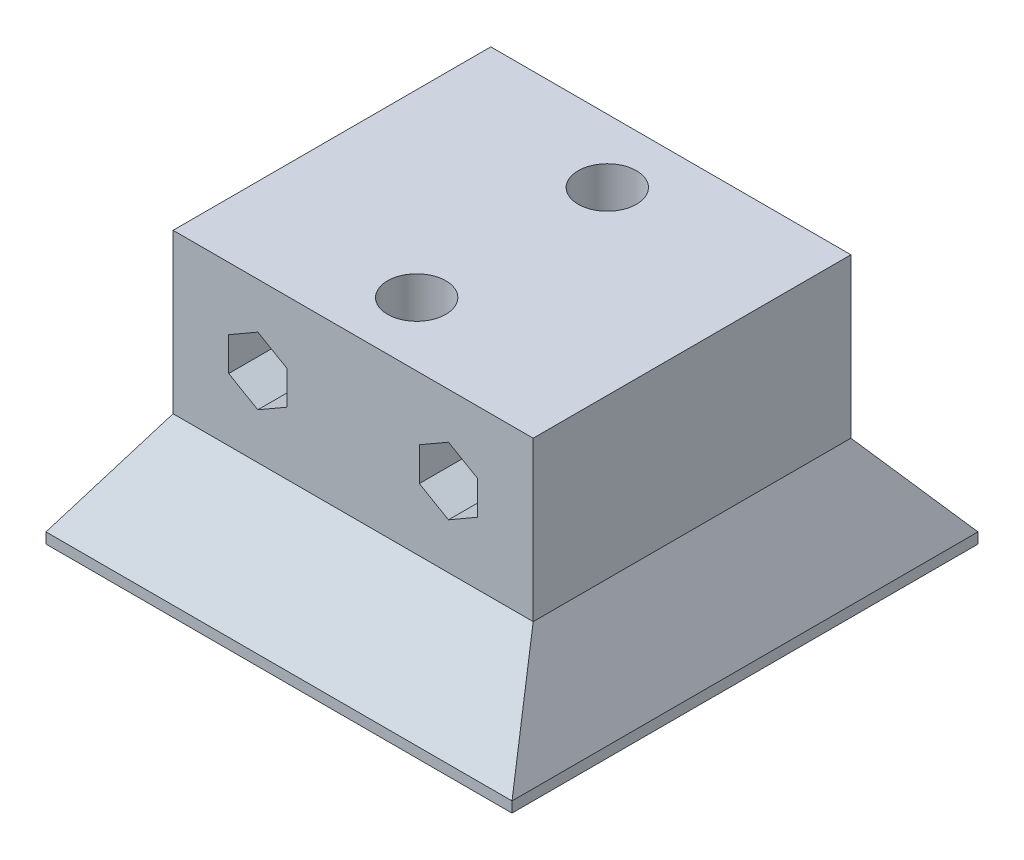
ISO-10303-21;
HEADER;
FILE_DESCRIPTION(('STEP AP214'),'2;1');
FILE_NAME('part.step','',(''),(''),'','','');
FILE_SCHEMA(('AUTOMOTIVE_DESIGN { 1 0 10303 214 1 1 1 1 }'));
ENDSEC;
DATA;
#1=APPLICATION_CONTEXT('core data for automotive mechanical design processes');
#2=APPLICATION_PROTOCOL_DEFINITION('international standard','automotive_design',2000,#1);
#3=PRODUCT_CONTEXT('',#1,'mechanical');
#4=PRODUCT('Part','Part','',(#3));
#5=PRODUCT_RELATED_PRODUCT_CATEGORY('part','',(#4));
#6=PRODUCT_DEFINITION_FORMATION('','',#4);
#7=PRODUCT_DEFINITION_CONTEXT('part definition',#1,'design');
#8=PRODUCT_DEFINITION('design','',#6,#7);
#9=PRODUCT_DEFINITION_SHAPE('','',#8);
#10=(LENGTH_UNIT() NAMED_UNIT(*) SI_UNIT(.MILLI.,.METRE.));
#11=(NAMED_UNIT(*) PLANE_ANGLE_UNIT() SI_UNIT($,.RADIAN.));
#12=(NAMED_UNIT(*) SI_UNIT($,.STERADIAN.) SOLID_ANGLE_UNIT());
#13=UNCERTAINTY_MEASURE_WITH_UNIT(LENGTH_MEASURE(1.E-05),#10,'distance_accuracy_value','');
#14=(GEOMETRIC_REPRESENTATION_CONTEXT(3) GLOBAL_UNCERTAINTY_ASSIGNED_CONTEXT((#13)) GLOBAL_UNIT_ASSIGNED_CONTEXT((#10,
#11,#12)) REPRESENTATION_CONTEXT('',''));
#15=CARTESIAN_POINT('',(0.,0.,0.));
#16=DIRECTION('',(0.,0.,1.));
#17=DIRECTION('',(1.,0.,0.));
#18=AXIS2_PLACEMENT_3D('',#15,#16,#17);
#19=CARTESIAN_POINT('',(0.,0.,30.));
#20=DIRECTION('',(1.,0.,0.));
#21=DIRECTION('',(0.,0.,-1.));
#22=AXIS2_PLACEMENT_3D('',#19,#20,#21);
#23=PLANE('',#22);
#24=DIRECTION('',(0.,-1.,0.));
#25=VECTOR('',#24,1.);
#26=CARTESIAN_POINT('',(0.,0.,0.));
#27=LINE('',#26,#25);
#28=CARTESIAN_POINT('',(0.,15.,0.));
#29=VERTEX_POINT('',#28);
#30=CARTESIAN_POINT('',(0.,0.,0.));
#31=VERTEX_POINT('',#30);
#32=EDGE_CURVE('E201',#29,#31,#27,.T.);
#33=ORIENTED_EDGE('',*,*,#32,.T.);
#34=DIRECTION('',(0.,0.,-1.));
#35=VECTOR('',#34,1.);
#36=CARTESIAN_POINT('',(0.,0.,30.));
#37=LINE('',#36,#35);
#38=CARTESIAN_POINT('',(0.,0.,30.));
#39=VERTEX_POINT('',#38);
#40=EDGE_CURVE('E191',#39,#31,#37,.T.);
#41=ORIENTED_EDGE('',*,*,#40,.F.);
#42=DIRECTION('',(0.,-1.,0.));
#43=VECTOR('',#42,1.);
#44=CARTESIAN_POINT('',(0.,0.,30.));
#45=LINE('',#44,#43);
#46=CARTESIAN_POINT('',(0.,15.,30.));
#47=VERTEX_POINT('',#46);
#48=EDGE_CURVE('E241',#47,#39,#45,.T.);
#49=ORIENTED_EDGE('',*,*,#48,.F.);
#50=DIRECTION('',(0.,0.,-1.));
#51=VECTOR('',#50,1.);
#52=CARTESIAN_POINT('',(0.,15.,30.));
#53=LINE('',#52,#51);
#54=EDGE_CURVE('E267',#47,#29,#53,.T.);
#55=ORIENTED_EDGE('',*,*,#54,.T.);
#56=EDGE_LOOP('',(#33,#41,#49,#55));
#57=FACE_BOUND('',#56,.T.);
#58=ADVANCED_FACE('F35',(#57),#23,.F.);
#59=CARTESIAN_POINT('',(34.,0.,30.));
#60=DIRECTION('',(-1.,0.,0.));
#61=DIRECTION('',(0.,0.,1.));
#62=AXIS2_PLACEMENT_3D('',#59,#60,#61);
#63=PLANE('',#62);
#64=DIRECTION('',(0.,1.,0.));
#65=VECTOR('',#64,1.);
#66=CARTESIAN_POINT('',(34.,0.,0.));
#67=LINE('',#66,#65);
#68=CARTESIAN_POINT('',(34.,0.,0.));
#69=VERTEX_POINT('',#68);
#70=CARTESIAN_POINT('',(34.,15.,0.));
#71=VERTEX_POINT('',#70);
#72=EDGE_CURVE('E263',#69,#71,#67,.T.);
#73=ORIENTED_EDGE('',*,*,#72,.T.);
#74=DIRECTION('',(0.,0.,-1.));
#75=VECTOR('',#74,1.);
#76=CARTESIAN_POINT('',(34.,15.,30.));
#77=LINE('',#76,#75);
#78=CARTESIAN_POINT('',(34.,15.,30.));
#79=VERTEX_POINT('',#78);
#80=EDGE_CURVE('E242',#79,#71,#77,.T.);
#81=ORIENTED_EDGE('',*,*,#80,.F.);
#82=DIRECTION('',(0.,1.,0.));
#83=VECTOR('',#82,1.);
#84=CARTESIAN_POINT('',(34.,0.,30.));
#85=LINE('',#84,#83);
#86=CARTESIAN_POINT('',(34.,0.,30.));
#87=VERTEX_POINT('',#86);
#88=EDGE_CURVE('E240',#87,#79,#85,.T.);
#89=ORIENTED_EDGE('',*,*,#88,.F.);
#90=DIRECTION('',(0.,0.,-1.));
#91=VECTOR('',#90,1.);
#92=CARTESIAN_POINT('',(34.,0.,30.));
#93=LINE('',#92,#91);
#94=EDGE_CURVE('E244',#87,#69,#93,.T.);
#95=ORIENTED_EDGE('',*,*,#94,.T.);
#96=EDGE_LOOP('',(#73,#81,#89,#95));
#97=FACE_BOUND('',#96,.T.);
#98=ADVANCED_FACE('F293',(#97),#63,.F.);
#99=CARTESIAN_POINT('',(0.,15.,30.));
#100=DIRECTION('',(0.,-1.,0.));
#101=DIRECTION('',(0.,0.,-1.));
#102=AXIS2_PLACEMENT_3D('',#99,#100,#101);
#103=PLANE('',#102);
#104=CARTESIAN_POINT('',(17.,15.,24.));
#105=DIRECTION('',(0.,1.,0.));
#106=DIRECTION('',(0.,0.,1.));
#107=AXIS2_PLACEMENT_3D('',#104,#105,#106);
#108=CIRCLE('',#107,2.75);
#109=CARTESIAN_POINT('',(17.,15.,26.75));
#110=VERTEX_POINT('',#109);
#111=EDGE_CURVE('E652',#110,#110,#108,.T.);
#112=ORIENTED_EDGE('',*,*,#111,.F.);
#113=EDGE_LOOP('',(#112));
#114=FACE_BOUND('',#113,.T.);
#115=CARTESIAN_POINT('',(17.,15.,6.));
#116=DIRECTION('',(0.,1.,0.));
#117=DIRECTION('',(0.,0.,1.));
#118=AXIS2_PLACEMENT_3D('',#115,#116,#117);
#119=CIRCLE('',#118,2.75);
#120=CARTESIAN_POINT('',(17.,15.,8.75));
#121=VERTEX_POINT('',#120);
#122=EDGE_CURVE('E654',#121,#121,#119,.T.);
#123=ORIENTED_EDGE('',*,*,#122,.F.);
#124=EDGE_LOOP('',(#123));
#125=FACE_BOUND('',#124,.T.);
#126=DIRECTION('',(-1.,0.,0.));
#127=VECTOR('',#126,1.);
#128=CARTESIAN_POINT('',(0.,15.,0.));
#129=LINE('',#128,#127);
#130=EDGE_CURVE('E254',#71,#29,#129,.T.);
#131=ORIENTED_EDGE('',*,*,#130,.T.);
#132=ORIENTED_EDGE('',*,*,#54,.F.);
#133=DIRECTION('',(-1.,0.,0.));
#134=VECTOR('',#133,1.);
#135=CARTESIAN_POINT('',(0.,15.,30.));
#136=LINE('',#135,#134);
#137=EDGE_CURVE('E233',#79,#47,#136,.T.);
#138=ORIENTED_EDGE('',*,*,#137,.F.);
#139=ORIENTED_EDGE('',*,*,#80,.T.);
#140=EDGE_LOOP('',(#131,#132,#138,#139));
#141=FACE_BOUND('',#140,.T.);
#142=ADVANCED_FACE('F281',(#114,#125,#141),#103,.F.);
#143=CARTESIAN_POINT('',(0.,0.,30.));
#144=DIRECTION('',(0.,0.,-1.));
#145=DIRECTION('',(-1.,0.,0.));
#146=AXIS2_PLACEMENT_3D('',#143,#144,#145);
#147=PLANE('',#146);
#148=DIRECTION('',(0.866025403784439,0.5,0.));
#149=VECTOR('',#148,1.);
#150=CARTESIAN_POINT('',(26.,4.32457351945706,30.));
#151=LINE('',#150,#149);
#152=CARTESIAN_POINT('',(26.,4.32457351945705,30.));
#153=VERTEX_POINT('',#152);
#154=CARTESIAN_POINT('',(28.75,5.91228675972853,30.));
#155=VERTEX_POINT('',#154);
#156=EDGE_CURVE('E676',#153,#155,#151,.T.);
#157=ORIENTED_EDGE('',*,*,#156,.F.);
#158=DIRECTION('',(0.866025403784439,-0.5,0.));
#159=VECTOR('',#158,1.);
#160=CARTESIAN_POINT('',(23.25,5.91228675972853,30.));
#161=LINE('',#160,#159);
#162=CARTESIAN_POINT('',(23.25,5.91228675972853,30.));
#163=VERTEX_POINT('',#162);
#164=EDGE_CURVE('E49',#163,#153,#161,.T.);
#165=ORIENTED_EDGE('',*,*,#164,.F.);
#166=DIRECTION('',(0.,-1.,0.));
#167=VECTOR('',#166,1.);
#168=CARTESIAN_POINT('',(23.25,9.08771324027147,30.));
#169=LINE('',#168,#167);
#170=CARTESIAN_POINT('',(23.25,9.08771324027147,30.));
#171=VERTEX_POINT('',#170);
#172=EDGE_CURVE('E359',#171,#163,#169,.T.);
#173=ORIENTED_EDGE('',*,*,#172,.F.);
#174=DIRECTION('',(-0.866025403784439,-0.5,0.));
#175=VECTOR('',#174,1.);
#176=CARTESIAN_POINT('',(26.,10.6754264805429,30.));
#177=LINE('',#176,#175);
#178=CARTESIAN_POINT('',(26.,10.6754264805429,30.));
#179=VERTEX_POINT('',#178);
#180=EDGE_CURVE('E334',#179,#171,#177,.T.);
#181=ORIENTED_EDGE('',*,*,#180,.F.);
#182=DIRECTION('',(-0.866025403784439,0.499999999999999,0.));
#183=VECTOR('',#182,1.);
#184=CARTESIAN_POINT('',(28.75,9.08771324027147,30.));
#185=LINE('',#184,#183);
#186=CARTESIAN_POINT('',(28.75,9.08771324027147,30.));
#187=VERTEX_POINT('',#186);
#188=EDGE_CURVE('E679',#187,#179,#185,.T.);
#189=ORIENTED_EDGE('',*,*,#188,.F.);
#190=DIRECTION('',(0.,1.,0.));
#191=VECTOR('',#190,1.);
#192=CARTESIAN_POINT('',(28.75,5.91228675972853,30.));
#193=LINE('',#192,#191);
#194=EDGE_CURVE('E351',#155,#187,#193,.T.);
#195=ORIENTED_EDGE('',*,*,#194,.F.);
#196=EDGE_LOOP('',(#157,#165,#173,#181,#189,#195));
#197=FACE_BOUND('',#196,.T.);
#198=DIRECTION('',(0.866025403784439,0.5,0.));
#199=VECTOR('',#198,1.);
#200=CARTESIAN_POINT('',(8.,4.32457351945706,30.));
#201=LINE('',#200,#199);
#202=CARTESIAN_POINT('',(8.,4.32457351945706,30.));
#203=VERTEX_POINT('',#202);
#204=CARTESIAN_POINT('',(10.75,5.91228675972853,30.));
#205=VERTEX_POINT('',#204);
#206=EDGE_CURVE('E362',#203,#205,#201,.T.);
#207=ORIENTED_EDGE('',*,*,#206,.F.);
#208=DIRECTION('',(0.866025403784439,-0.5,0.));
#209=VECTOR('',#208,1.);
#210=CARTESIAN_POINT('',(5.25,5.91228675972853,30.));
#211=LINE('',#210,#209);
#212=CARTESIAN_POINT('',(5.25,5.91228675972853,30.));
#213=VERTEX_POINT('',#212);
#214=EDGE_CURVE('E360',#213,#203,#211,.T.);
#215=ORIENTED_EDGE('',*,*,#214,.F.);
#216=DIRECTION('',(0.,-1.,0.));
#217=VECTOR('',#216,1.);
#218=CARTESIAN_POINT('',(5.25,9.08771324027147,30.));
#219=LINE('',#218,#217);
#220=CARTESIAN_POINT('',(5.25,9.08771324027147,30.));
#221=VERTEX_POINT('',#220);
#222=EDGE_CURVE('E374',#221,#213,#219,.T.);
#223=ORIENTED_EDGE('',*,*,#222,.F.);
#224=DIRECTION('',(-0.866025403784439,-0.5,0.));
#225=VECTOR('',#224,1.);
#226=CARTESIAN_POINT('',(8.,10.6754264805429,30.));
#227=LINE('',#226,#225);
#228=CARTESIAN_POINT('',(8.,10.6754264805429,30.));
#229=VERTEX_POINT('',#228);
#230=EDGE_CURVE('E371',#229,#221,#227,.T.);
#231=ORIENTED_EDGE('',*,*,#230,.F.);
#232=DIRECTION('',(-0.866025403784439,0.5,0.));
#233=VECTOR('',#232,1.);
#234=CARTESIAN_POINT('',(10.75,9.08771324027147,30.));
#235=LINE('',#234,#233);
#236=CARTESIAN_POINT('',(10.75,9.08771324027147,30.));
#237=VERTEX_POINT('',#236);
#238=EDGE_CURVE('E368',#237,#229,#235,.T.);
#239=ORIENTED_EDGE('',*,*,#238,.F.);
#240=DIRECTION('',(0.,1.,0.));
#241=VECTOR('',#240,1.);
#242=CARTESIAN_POINT('',(10.75,5.91228675972853,30.));
#243=LINE('',#242,#241);
#244=EDGE_CURVE('E365',#205,#237,#243,.T.);
#245=ORIENTED_EDGE('',*,*,#244,.F.);
#246=EDGE_LOOP('',(#207,#215,#223,#231,#239,#245));
#247=FACE_BOUND('',#246,.T.);
#248=ORIENTED_EDGE('',*,*,#48,.T.);
#249=DIRECTION('',(1.,0.,0.));
#250=VECTOR('',#249,1.);
#251=CARTESIAN_POINT('',(0.,0.,30.));
#252=LINE('',#251,#250);
#253=EDGE_CURVE('E236',#39,#87,#252,.T.);
#254=ORIENTED_EDGE('',*,*,#253,.T.);
#255=ORIENTED_EDGE('',*,*,#88,.T.);
#256=ORIENTED_EDGE('',*,*,#137,.T.);
#257=EDGE_LOOP('',(#248,#254,#255,#256));
#258=FACE_BOUND('',#257,.T.);
#259=ADVANCED_FACE('F277',(#197,#247,#258),#147,.F.);
#260=CARTESIAN_POINT('',(0.,0.,0.));
#261=DIRECTION('',(0.,0.,-1.));
#262=DIRECTION('',(-1.,0.,0.));
#263=AXIS2_PLACEMENT_3D('',#260,#261,#262);
#264=PLANE('',#263);
#265=DIRECTION('',(-0.866025403784439,0.5,0.));
#266=VECTOR('',#265,1.);
#267=CARTESIAN_POINT('',(8.37259526419165,14.5017603887905,0.));
#268=LINE('',#267,#266);
#269=CARTESIAN_POINT('',(26.,4.32457351945706,0.));
#270=VERTEX_POINT('',#269);
#271=CARTESIAN_POINT('',(23.25,5.91228675972853,0.));
#272=VERTEX_POINT('',#271);
#273=EDGE_CURVE('E11',#270,#272,#268,.T.);
#274=ORIENTED_EDGE('',*,*,#273,.F.);
#275=DIRECTION('',(-0.866025403784439,-0.5,0.));
#276=VECTOR('',#275,1.);
#277=CARTESIAN_POINT('',(4.62740473580834,-8.0149001096049,0.));
#278=LINE('',#277,#276);
#279=CARTESIAN_POINT('',(28.75,5.91228675972853,0.));
#280=VERTEX_POINT('',#279);
#281=EDGE_CURVE('E311',#280,#270,#278,.T.);
#282=ORIENTED_EDGE('',*,*,#281,.F.);
#283=DIRECTION('',(0.,-1.,0.));
#284=VECTOR('',#283,1.);
#285=CARTESIAN_POINT('',(28.75,0.,0.));
#286=LINE('',#285,#284);
#287=CARTESIAN_POINT('',(28.75,9.08771324027147,0.));
#288=VERTEX_POINT('',#287);
#289=EDGE_CURVE('E313',#288,#280,#286,.T.);
#290=ORIENTED_EDGE('',*,*,#289,.F.);
#291=DIRECTION('',(0.866025403784439,-0.499999999999999,0.));
#292=VECTOR('',#291,1.);
#293=CARTESIAN_POINT('',(11.1225952641916,19.2649001096049,0.));
#294=LINE('',#293,#292);
#295=CARTESIAN_POINT('',(26.,10.6754264805429,0.));
#296=VERTEX_POINT('',#295);
#297=EDGE_CURVE('E315',#296,#288,#294,.T.);
#298=ORIENTED_EDGE('',*,*,#297,.F.);
#299=DIRECTION('',(0.866025403784439,0.5,0.));
#300=VECTOR('',#299,1.);
#301=CARTESIAN_POINT('',(1.87740473580836,-3.2517603887905,0.));
#302=LINE('',#301,#300);
#303=CARTESIAN_POINT('',(23.25,9.08771324027147,0.));
#304=VERTEX_POINT('',#303);
#305=EDGE_CURVE('E317',#304,#296,#302,.T.);
#306=ORIENTED_EDGE('',*,*,#305,.F.);
#307=DIRECTION('',(0.,1.,0.));
#308=VECTOR('',#307,1.);
#309=CARTESIAN_POINT('',(23.25,0.,0.));
#310=LINE('',#309,#308);
#311=EDGE_CURVE('E42',#272,#304,#310,.T.);
#312=ORIENTED_EDGE('',*,*,#311,.F.);
#313=EDGE_LOOP('',(#274,#282,#290,#298,#306,#312));
#314=FACE_BOUND('',#313,.T.);
#315=DIRECTION('',(-0.866025403784439,0.5,0.));
#316=VECTOR('',#315,1.);
#317=CARTESIAN_POINT('',(3.87259526419164,6.70753175473055,0.));
#318=LINE('',#317,#316);
#319=CARTESIAN_POINT('',(8.,4.32457351945706,0.));
#320=VERTEX_POINT('',#319);
#321=CARTESIAN_POINT('',(5.25,5.91228675972853,0.));
#322=VERTEX_POINT('',#321);
#323=EDGE_CURVE('E309',#320,#322,#318,.T.);
#324=ORIENTED_EDGE('',*,*,#323,.F.);
#325=DIRECTION('',(-0.866025403784439,-0.5,0.));
#326=VECTOR('',#325,1.);
#327=CARTESIAN_POINT('',(0.127404735808353,-0.220671475544957,0.));
#328=LINE('',#327,#326);
#329=CARTESIAN_POINT('',(10.75,5.91228675972853,0.));
#330=VERTEX_POINT('',#329);
#331=EDGE_CURVE('E258',#330,#320,#328,.T.);
#332=ORIENTED_EDGE('',*,*,#331,.F.);
#333=DIRECTION('',(0.,-1.,0.));
#334=VECTOR('',#333,1.);
#335=CARTESIAN_POINT('',(10.75,0.,0.));
#336=LINE('',#335,#334);
#337=CARTESIAN_POINT('',(10.75,9.08771324027147,0.));
#338=VERTEX_POINT('',#337);
#339=EDGE_CURVE('E300',#338,#330,#336,.T.);
#340=ORIENTED_EDGE('',*,*,#339,.F.);
#341=DIRECTION('',(0.866025403784439,-0.5,0.));
#342=VECTOR('',#341,1.);
#343=CARTESIAN_POINT('',(6.62259526419164,11.470671475545,0.));
#344=LINE('',#343,#342);
#345=CARTESIAN_POINT('',(8.,10.6754264805429,0.));
#346=VERTEX_POINT('',#345);
#347=EDGE_CURVE('E303',#346,#338,#344,.T.);
#348=ORIENTED_EDGE('',*,*,#347,.F.);
#349=DIRECTION('',(0.866025403784439,0.5,0.));
#350=VECTOR('',#349,1.);
#351=CARTESIAN_POINT('',(-2.62259526419165,4.54246824526945,0.));
#352=LINE('',#351,#350);
#353=CARTESIAN_POINT('',(5.25,9.08771324027147,0.));
#354=VERTEX_POINT('',#353);
#355=EDGE_CURVE('E305',#354,#346,#352,.T.);
#356=ORIENTED_EDGE('',*,*,#355,.F.);
#357=DIRECTION('',(0.,1.,0.));
#358=VECTOR('',#357,1.);
#359=CARTESIAN_POINT('',(5.25,0.,0.));
#360=LINE('',#359,#358);
#361=EDGE_CURVE('E307',#322,#354,#360,.T.);
#362=ORIENTED_EDGE('',*,*,#361,.F.);
#363=EDGE_LOOP('',(#324,#332,#340,#348,#356,#362));
#364=FACE_BOUND('',#363,.T.);
#365=ORIENTED_EDGE('',*,*,#32,.F.);
#366=ORIENTED_EDGE('',*,*,#130,.F.);
#367=ORIENTED_EDGE('',*,*,#72,.F.);
#368=DIRECTION('',(1.,0.,0.));
#369=VECTOR('',#368,1.);
#370=CARTESIAN_POINT('',(0.,0.,0.));
#371=LINE('',#370,#369);
#372=EDGE_CURVE('E261',#31,#69,#371,.T.);
#373=ORIENTED_EDGE('',*,*,#372,.F.);
#374=EDGE_LOOP('',(#365,#366,#367,#373));
#375=FACE_BOUND('',#374,.T.);
#376=ADVANCED_FACE('F284',(#314,#364,#375),#264,.T.);
#377=CARTESIAN_POINT('',(0.,0.,37.));
#378=DIRECTION('',(0.866025403784437,-0.500000000000003,0.));
#379=DIRECTION('',(0.500000000000003,0.866025403784437,0.));
#380=AXIS2_PLACEMENT_3D('',#377,#378,#379);
#381=PLANE('',#380);
#382=ORIENTED_EDGE('',*,*,#40,.T.);
#383=DIRECTION('',(-0.409615960259522,-0.7094756547606,-0.573462344363331));
#384=VECTOR('',#383,1.);
#385=CARTESIAN_POINT('',(8.6912751677853,15.0537301731657,12.1677852348994));
#386=LINE('',#385,#384);
#387=CARTESIAN_POINT('',(-5.,-8.66025403784432,-7.));
#388=VERTEX_POINT('',#387);
#389=EDGE_CURVE('E173',#31,#388,#386,.T.);
#390=ORIENTED_EDGE('',*,*,#389,.T.);
#391=DIRECTION('',(0.,0.,-1.));
#392=VECTOR('',#391,1.);
#393=CARTESIAN_POINT('',(-5.,-8.66025403784432,37.));
#394=LINE('',#393,#392);
#395=CARTESIAN_POINT('',(-5.,-8.66025403784432,37.));
#396=VERTEX_POINT('',#395);
#397=EDGE_CURVE('E188',#396,#388,#394,.T.);
#398=ORIENTED_EDGE('',*,*,#397,.F.);
#399=DIRECTION('',(0.409615960259522,0.7094756547606,-0.573462344363331));
#400=VECTOR('',#399,1.);
#401=CARTESIAN_POINT('',(-1.64429530201344,-2.84800300573406,32.3020134228188));
#402=LINE('',#401,#400);
#403=EDGE_CURVE('E669',#396,#39,#402,.T.);
#404=ORIENTED_EDGE('',*,*,#403,.T.);
#405=EDGE_LOOP('',(#382,#390,#398,#404));
#406=FACE_BOUND('',#405,.T.);
#407=ADVANCED_FACE('F186',(#406),#381,.F.);
#408=CARTESIAN_POINT('',(-5.,-8.66025403784432,37.));
#409=DIRECTION('',(1.,0.,0.));
#410=DIRECTION('',(0.,1.,0.));
#411=AXIS2_PLACEMENT_3D('',#408,#409,#410);
#412=PLANE('',#411);
#413=ORIENTED_EDGE('',*,*,#397,.T.);
#414=DIRECTION('',(0.,-1.,0.));
#415=VECTOR('',#414,1.);
#416=CARTESIAN_POINT('',(-5.,-8.66025403784432,-7.));
#417=LINE('',#416,#415);
#418=CARTESIAN_POINT('',(-5.,-9.66025403784431,-7.));
#419=VERTEX_POINT('',#418);
#420=EDGE_CURVE('E199',#388,#419,#417,.T.);
#421=ORIENTED_EDGE('',*,*,#420,.T.);
#422=DIRECTION('',(0.,0.,-1.));
#423=VECTOR('',#422,1.);
#424=CARTESIAN_POINT('',(-5.,-9.66025403784431,37.));
#425=LINE('',#424,#423);
#426=CARTESIAN_POINT('',(-5.,-9.66025403784431,37.));
#427=VERTEX_POINT('',#426);
#428=EDGE_CURVE('E202',#427,#419,#425,.T.);
#429=ORIENTED_EDGE('',*,*,#428,.F.);
#430=DIRECTION('',(0.,-1.,0.));
#431=VECTOR('',#430,1.);
#432=CARTESIAN_POINT('',(-5.,-8.66025403784432,37.));
#433=LINE('',#432,#431);
#434=EDGE_CURVE('E200',#396,#427,#433,.T.);
#435=ORIENTED_EDGE('',*,*,#434,.F.);
#436=EDGE_LOOP('',(#413,#421,#429,#435));
#437=FACE_BOUND('',#436,.T.);
#438=ADVANCED_FACE('F197',(#437),#412,.F.);
#439=CARTESIAN_POINT('',(-5.,-9.66025403784431,37.));
#440=DIRECTION('',(0.,1.,0.));
#441=DIRECTION('',(0.,0.,1.));
#442=AXIS2_PLACEMENT_3D('',#439,#440,#441);
#443=PLANE('',#442);
#444=CARTESIAN_POINT('',(17.,-9.66025403784431,24.));
#445=DIRECTION('',(0.,1.,0.));
#446=DIRECTION('',(0.,0.,1.));
#447=AXIS2_PLACEMENT_3D('',#444,#445,#446);
#448=CIRCLE('',#447,2.75);
#449=CARTESIAN_POINT('',(17.,-9.66025403784431,26.75));
#450=VERTEX_POINT('',#449);
#451=EDGE_CURVE('E649',#450,#450,#448,.T.);
#452=ORIENTED_EDGE('',*,*,#451,.T.);
#453=EDGE_LOOP('',(#452));
#454=FACE_BOUND('',#453,.T.);
#455=CARTESIAN_POINT('',(17.,-9.66025403784431,6.));
#456=DIRECTION('',(0.,1.,0.));
#457=DIRECTION('',(0.,0.,1.));
#458=AXIS2_PLACEMENT_3D('',#455,#456,#457);
#459=CIRCLE('',#458,2.75);
#460=CARTESIAN_POINT('',(17.,-9.66025403784431,8.75));
#461=VERTEX_POINT('',#460);
#462=EDGE_CURVE('E181',#461,#461,#459,.T.);
#463=ORIENTED_EDGE('',*,*,#462,.T.);
#464=EDGE_LOOP('',(#463));
#465=FACE_BOUND('',#464,.T.);
#466=ORIENTED_EDGE('',*,*,#428,.T.);
#467=DIRECTION('',(1.,0.,0.));
#468=VECTOR('',#467,1.);
#469=CARTESIAN_POINT('',(-5.,-9.66025403784431,-7.));
#470=LINE('',#469,#468);
#471=CARTESIAN_POINT('',(39.,-9.66025403784431,-7.));
#472=VERTEX_POINT('',#471);
#473=EDGE_CURVE('E207',#419,#472,#470,.T.);
#474=ORIENTED_EDGE('',*,*,#473,.T.);
#475=DIRECTION('',(0.,0.,-1.));
#476=VECTOR('',#475,1.);
#477=CARTESIAN_POINT('',(39.,-9.66025403784431,37.));
#478=LINE('',#477,#476);
#479=CARTESIAN_POINT('',(39.,-9.66025403784431,37.));
#480=VERTEX_POINT('',#479);
#481=EDGE_CURVE('E228',#480,#472,#478,.T.);
#482=ORIENTED_EDGE('',*,*,#481,.F.);
#483=DIRECTION('',(1.,0.,0.));
#484=VECTOR('',#483,1.);
#485=CARTESIAN_POINT('',(-5.,-9.66025403784431,37.));
#486=LINE('',#485,#484);
#487=EDGE_CURVE('E221',#427,#480,#486,.T.);
#488=ORIENTED_EDGE('',*,*,#487,.F.);
#489=EDGE_LOOP('',(#466,#474,#482,#488));
#490=FACE_BOUND('',#489,.T.);
#491=ADVANCED_FACE('F440',(#454,#465,#490),#443,.F.);
#492=CARTESIAN_POINT('',(39.,-9.66025403784431,37.));
#493=DIRECTION('',(-1.,0.,0.));
#494=DIRECTION('',(0.,0.,1.));
#495=AXIS2_PLACEMENT_3D('',#492,#493,#494);
#496=PLANE('',#495);
#497=ORIENTED_EDGE('',*,*,#481,.T.);
#498=DIRECTION('',(0.,1.,0.));
#499=VECTOR('',#498,1.);
#500=CARTESIAN_POINT('',(39.,-9.66025403784431,-7.));
#501=LINE('',#500,#499);
#502=CARTESIAN_POINT('',(39.,-8.66025403784432,-7.));
#503=VERTEX_POINT('',#502);
#504=EDGE_CURVE('E210',#472,#503,#501,.T.);
#505=ORIENTED_EDGE('',*,*,#504,.T.);
#506=DIRECTION('',(0.,0.,-1.));
#507=VECTOR('',#506,1.);
#508=CARTESIAN_POINT('',(39.,-8.66025403784432,37.));
#509=LINE('',#508,#507);
#510=CARTESIAN_POINT('',(39.,-8.66025403784432,37.));
#511=VERTEX_POINT('',#510);
#512=EDGE_CURVE('E226',#511,#503,#509,.T.);
#513=ORIENTED_EDGE('',*,*,#512,.F.);
#514=DIRECTION('',(0.,1.,0.));
#515=VECTOR('',#514,1.);
#516=CARTESIAN_POINT('',(39.,-9.66025403784431,37.));
#517=LINE('',#516,#515);
#518=EDGE_CURVE('E223',#480,#511,#517,.T.);
#519=ORIENTED_EDGE('',*,*,#518,.F.);
#520=EDGE_LOOP('',(#497,#505,#513,#519));
#521=FACE_BOUND('',#520,.T.);
#522=ADVANCED_FACE('F443',(#521),#496,.F.);
#523=CARTESIAN_POINT('',(39.,-8.66025403784432,37.));
#524=DIRECTION('',(-0.866025403784437,-0.500000000000003,0.));
#525=DIRECTION('',(0.500000000000003,-0.866025403784437,0.));
#526=AXIS2_PLACEMENT_3D('',#523,#524,#525);
#527=PLANE('',#526);
#528=ORIENTED_EDGE('',*,*,#512,.T.);
#529=DIRECTION('',(-0.409615960259522,0.7094756547606,0.573462344363331));
#530=VECTOR('',#529,1.);
#531=CARTESIAN_POINT('',(28.6644295302013,9.24147914105549,7.46979865771824));
#532=LINE('',#531,#530);
#533=EDGE_CURVE('E176',#503,#69,#532,.T.);
#534=ORIENTED_EDGE('',*,*,#533,.T.);
#535=ORIENTED_EDGE('',*,*,#94,.F.);
#536=DIRECTION('',(0.409615960259522,-0.7094756547606,0.573462344363331));
#537=VECTOR('',#536,1.);
#538=CARTESIAN_POINT('',(39.,-8.66025403784432,37.));
#539=LINE('',#538,#537);
#540=EDGE_CURVE('E667',#87,#511,#539,.T.);
#541=ORIENTED_EDGE('',*,*,#540,.T.);
#542=EDGE_LOOP('',(#528,#534,#535,#541));
#543=FACE_BOUND('',#542,.T.);
#544=ADVANCED_FACE('F288',(#543),#527,.F.);
#545=CARTESIAN_POINT('',(0.,0.,37.));
#546=DIRECTION('',(0.,0.,1.));
#547=DIRECTION('',(1.,0.,0.));
#548=AXIS2_PLACEMENT_3D('',#545,#546,#547);
#549=PLANE('',#548);
#550=DIRECTION('',(-1.,0.,0.));
#551=VECTOR('',#550,1.);
#552=CARTESIAN_POINT('',(39.,-8.66025403784432,37.));
#553=LINE('',#552,#551);
#554=EDGE_CURVE('E193',#511,#396,#553,.T.);
#555=ORIENTED_EDGE('',*,*,#554,.T.);
#556=ORIENTED_EDGE('',*,*,#434,.T.);
#557=ORIENTED_EDGE('',*,*,#487,.T.);
#558=ORIENTED_EDGE('',*,*,#518,.T.);
#559=EDGE_LOOP('',(#555,#556,#557,#558));
#560=FACE_BOUND('',#559,.T.);
#561=ADVANCED_FACE('F450',(#560),#549,.T.);
#562=CARTESIAN_POINT('',(0.,0.,-7.));
#563=DIRECTION('',(0.,0.,1.));
#564=DIRECTION('',(1.,0.,0.));
#565=AXIS2_PLACEMENT_3D('',#562,#563,#564);
#566=PLANE('',#565);
#567=ORIENTED_EDGE('',*,*,#420,.F.);
#568=DIRECTION('',(-1.,0.,0.));
#569=VECTOR('',#568,1.);
#570=CARTESIAN_POINT('',(39.,-8.66025403784432,-7.));
#571=LINE('',#570,#569);
#572=EDGE_CURVE('E170',#503,#388,#571,.T.);
#573=ORIENTED_EDGE('',*,*,#572,.F.);
#574=ORIENTED_EDGE('',*,*,#504,.F.);
#575=ORIENTED_EDGE('',*,*,#473,.F.);
#576=EDGE_LOOP('',(#567,#573,#574,#575));
#577=FACE_BOUND('',#576,.T.);
#578=ADVANCED_FACE('F205',(#577),#566,.F.);
#579=CARTESIAN_POINT('',(5.25,5.91228675972853,-7.000025));
#580=DIRECTION('',(-0.5,-0.866025403784439,0.));
#581=DIRECTION('',(0.866025403784439,-0.5,0.));
#582=AXIS2_PLACEMENT_3D('',#579,#580,#581);
#583=PLANE('',#582);
#584=ORIENTED_EDGE('',*,*,#323,.T.);
#585=DIRECTION('',(0.,0.,1.));
#586=VECTOR('',#585,1.);
#587=CARTESIAN_POINT('',(5.25,5.91228675972853,-7.000025));
#588=LINE('',#587,#586);
#589=EDGE_CURVE('E208',#322,#213,#588,.T.);
#590=ORIENTED_EDGE('',*,*,#589,.T.);
#591=ORIENTED_EDGE('',*,*,#214,.T.);
#592=DIRECTION('',(0.,0.,1.));
#593=VECTOR('',#592,1.);
#594=CARTESIAN_POINT('',(8.,4.32457351945706,-7.000025));
#595=LINE('',#594,#593);
#596=EDGE_CURVE('E215',#320,#203,#595,.T.);
#597=ORIENTED_EDGE('',*,*,#596,.F.);
#598=EDGE_LOOP('',(#584,#590,#591,#597));
#599=FACE_BOUND('',#598,.T.);
#600=ADVANCED_FACE('F405',(#599),#583,.F.);
#601=CARTESIAN_POINT('',(5.25,9.08771324027147,-7.000025));
#602=DIRECTION('',(-1.,0.,0.));
#603=DIRECTION('',(0.,0.,1.));
#604=AXIS2_PLACEMENT_3D('',#601,#602,#603);
#605=PLANE('',#604);
#606=ORIENTED_EDGE('',*,*,#361,.T.);
#607=DIRECTION('',(0.,0.,1.));
#608=VECTOR('',#607,1.);
#609=CARTESIAN_POINT('',(5.25,9.08771324027147,-7.000025));
#610=LINE('',#609,#608);
#611=EDGE_CURVE('E212',#354,#221,#610,.T.);
#612=ORIENTED_EDGE('',*,*,#611,.T.);
#613=ORIENTED_EDGE('',*,*,#222,.T.);
#614=ORIENTED_EDGE('',*,*,#589,.F.);
#615=EDGE_LOOP('',(#606,#612,#613,#614));
#616=FACE_BOUND('',#615,.T.);
#617=ADVANCED_FACE('F407',(#616),#605,.F.);
#618=CARTESIAN_POINT('',(8.,10.6754264805429,-7.000025));
#619=DIRECTION('',(-0.5,0.866025403784439,0.));
#620=DIRECTION('',(-0.866025403784439,-0.5,0.));
#621=AXIS2_PLACEMENT_3D('',#618,#619,#620);
#622=PLANE('',#621);
#623=ORIENTED_EDGE('',*,*,#355,.T.);
#624=DIRECTION('',(0.,0.,1.));
#625=VECTOR('',#624,1.);
#626=CARTESIAN_POINT('',(8.,10.6754264805429,-7.000025));
#627=LINE('',#626,#625);
#628=EDGE_CURVE('E378',#346,#229,#627,.T.);
#629=ORIENTED_EDGE('',*,*,#628,.T.);
#630=ORIENTED_EDGE('',*,*,#230,.T.);
#631=ORIENTED_EDGE('',*,*,#611,.F.);
#632=EDGE_LOOP('',(#623,#629,#630,#631));
#633=FACE_BOUND('',#632,.T.);
#634=ADVANCED_FACE('F410',(#633),#622,.F.);
#635=CARTESIAN_POINT('',(10.75,9.08771324027147,-7.000025));
#636=DIRECTION('',(0.5,0.866025403784439,0.));
#637=DIRECTION('',(-0.866025403784439,0.5,0.));
#638=AXIS2_PLACEMENT_3D('',#635,#636,#637);
#639=PLANE('',#638);
#640=ORIENTED_EDGE('',*,*,#347,.T.);
#641=DIRECTION('',(0.,0.,1.));
#642=VECTOR('',#641,1.);
#643=CARTESIAN_POINT('',(10.75,9.08771324027147,-7.000025));
#644=LINE('',#643,#642);
#645=EDGE_CURVE('E380',#338,#237,#644,.T.);
#646=ORIENTED_EDGE('',*,*,#645,.T.);
#647=ORIENTED_EDGE('',*,*,#238,.T.);
#648=ORIENTED_EDGE('',*,*,#628,.F.);
#649=EDGE_LOOP('',(#640,#646,#647,#648));
#650=FACE_BOUND('',#649,.T.);
#651=ADVANCED_FACE('F412',(#650),#639,.F.);
#652=CARTESIAN_POINT('',(10.75,5.91228675972853,-7.000025));
#653=DIRECTION('',(1.,0.,0.));
#654=DIRECTION('',(0.,0.,-1.));
#655=AXIS2_PLACEMENT_3D('',#652,#653,#654);
#656=PLANE('',#655);
#657=ORIENTED_EDGE('',*,*,#339,.T.);
#658=DIRECTION('',(0.,0.,1.));
#659=VECTOR('',#658,1.);
#660=CARTESIAN_POINT('',(10.75,5.91228675972853,-7.000025));
#661=LINE('',#660,#659);
#662=EDGE_CURVE('E381',#330,#205,#661,.T.);
#663=ORIENTED_EDGE('',*,*,#662,.T.);
#664=ORIENTED_EDGE('',*,*,#244,.T.);
#665=ORIENTED_EDGE('',*,*,#645,.F.);
#666=EDGE_LOOP('',(#657,#663,#664,#665));
#667=FACE_BOUND('',#666,.T.);
#668=ADVANCED_FACE('F398',(#667),#656,.F.);
#669=CARTESIAN_POINT('',(8.,4.32457351945706,-7.000025));
#670=DIRECTION('',(0.5,-0.866025403784439,0.));
#671=DIRECTION('',(0.866025403784439,0.5,0.));
#672=AXIS2_PLACEMENT_3D('',#669,#670,#671);
#673=PLANE('',#672);
#674=ORIENTED_EDGE('',*,*,#331,.T.);
#675=ORIENTED_EDGE('',*,*,#596,.T.);
#676=ORIENTED_EDGE('',*,*,#206,.T.);
#677=ORIENTED_EDGE('',*,*,#662,.F.);
#678=EDGE_LOOP('',(#674,#675,#676,#677));
#679=FACE_BOUND('',#678,.T.);
#680=ADVANCED_FACE('F387',(#679),#673,.F.);
#681=CARTESIAN_POINT('',(23.25,5.91228675972853,-7.000025));
#682=DIRECTION('',(-0.5,-0.866025403784439,0.));
#683=DIRECTION('',(0.866025403784439,-0.5,0.));
#684=AXIS2_PLACEMENT_3D('',#681,#682,#683);
#685=PLANE('',#684);
#686=ORIENTED_EDGE('',*,*,#273,.T.);
#687=DIRECTION('',(0.,0.,1.));
#688=VECTOR('',#687,1.);
#689=CARTESIAN_POINT('',(23.25,5.91228675972853,-7.000025));
#690=LINE('',#689,#688);
#691=EDGE_CURVE('E326',#272,#163,#690,.T.);
#692=ORIENTED_EDGE('',*,*,#691,.T.);
#693=ORIENTED_EDGE('',*,*,#164,.T.);
#694=DIRECTION('',(0.,0.,1.));
#695=VECTOR('',#694,1.);
#696=CARTESIAN_POINT('',(26.,4.32457351945706,-7.000025));
#697=LINE('',#696,#695);
#698=EDGE_CURVE('E355',#270,#153,#697,.T.);
#699=ORIENTED_EDGE('',*,*,#698,.F.);
#700=EDGE_LOOP('',(#686,#692,#693,#699));
#701=FACE_BOUND('',#700,.T.);
#702=ADVANCED_FACE('F459',(#701),#685,.F.);
#703=CARTESIAN_POINT('',(23.25,9.08771324027147,-7.000025));
#704=DIRECTION('',(-1.,0.,0.));
#705=DIRECTION('',(0.,0.,1.));
#706=AXIS2_PLACEMENT_3D('',#703,#704,#705);
#707=PLANE('',#706);
#708=ORIENTED_EDGE('',*,*,#311,.T.);
#709=DIRECTION('',(0.,0.,1.));
#710=VECTOR('',#709,1.);
#711=CARTESIAN_POINT('',(23.25,9.08771324027147,-7.000025));
#712=LINE('',#711,#710);
#713=EDGE_CURVE('E324',#304,#171,#712,.T.);
#714=ORIENTED_EDGE('',*,*,#713,.T.);
#715=ORIENTED_EDGE('',*,*,#172,.T.);
#716=ORIENTED_EDGE('',*,*,#691,.F.);
#717=EDGE_LOOP('',(#708,#714,#715,#716));
#718=FACE_BOUND('',#717,.T.);
#719=ADVANCED_FACE('F322',(#718),#707,.F.);
#720=CARTESIAN_POINT('',(26.,10.6754264805429,-7.000025));
#721=DIRECTION('',(-0.5,0.866025403784439,0.));
#722=DIRECTION('',(-0.866025403784439,-0.5,0.));
#723=AXIS2_PLACEMENT_3D('',#720,#721,#722);
#724=PLANE('',#723);
#725=ORIENTED_EDGE('',*,*,#305,.T.);
#726=DIRECTION('',(0.,0.,1.));
#727=VECTOR('',#726,1.);
#728=CARTESIAN_POINT('',(26.,10.6754264805429,-7.000025));
#729=LINE('',#728,#727);
#730=EDGE_CURVE('E336',#296,#179,#729,.T.);
#731=ORIENTED_EDGE('',*,*,#730,.T.);
#732=ORIENTED_EDGE('',*,*,#180,.T.);
#733=ORIENTED_EDGE('',*,*,#713,.F.);
#734=EDGE_LOOP('',(#725,#731,#732,#733));
#735=FACE_BOUND('',#734,.T.);
#736=ADVANCED_FACE('F331',(#735),#724,.F.);
#737=CARTESIAN_POINT('',(28.75,9.08771324027147,-7.000025));
#738=DIRECTION('',(0.499999999999999,0.866025403784439,0.));
#739=DIRECTION('',(-0.866025403784439,0.499999999999999,0.));
#740=AXIS2_PLACEMENT_3D('',#737,#738,#739);
#741=PLANE('',#740);
#742=ORIENTED_EDGE('',*,*,#297,.T.);
#743=DIRECTION('',(0.,0.,1.));
#744=VECTOR('',#743,1.);
#745=CARTESIAN_POINT('',(28.75,9.08771324027147,-7.000025));
#746=LINE('',#745,#744);
#747=EDGE_CURVE('E346',#288,#187,#746,.T.);
#748=ORIENTED_EDGE('',*,*,#747,.T.);
#749=ORIENTED_EDGE('',*,*,#188,.T.);
#750=ORIENTED_EDGE('',*,*,#730,.F.);
#751=EDGE_LOOP('',(#742,#748,#749,#750));
#752=FACE_BOUND('',#751,.T.);
#753=ADVANCED_FACE('F344',(#752),#741,.F.);
#754=CARTESIAN_POINT('',(28.75,5.91228675972853,-7.000025));
#755=DIRECTION('',(1.,0.,0.));
#756=DIRECTION('',(0.,0.,-1.));
#757=AXIS2_PLACEMENT_3D('',#754,#755,#756);
#758=PLANE('',#757);
#759=ORIENTED_EDGE('',*,*,#289,.T.);
#760=DIRECTION('',(0.,0.,1.));
#761=VECTOR('',#760,1.);
#762=CARTESIAN_POINT('',(28.75,5.91228675972853,-7.000025));
#763=LINE('',#762,#761);
#764=EDGE_CURVE('E57',#280,#155,#763,.T.);
#765=ORIENTED_EDGE('',*,*,#764,.T.);
#766=ORIENTED_EDGE('',*,*,#194,.T.);
#767=ORIENTED_EDGE('',*,*,#747,.F.);
#768=EDGE_LOOP('',(#759,#765,#766,#767));
#769=FACE_BOUND('',#768,.T.);
#770=ADVANCED_FACE('F349',(#769),#758,.F.);
#771=CARTESIAN_POINT('',(26.,4.32457351945706,-7.000025));
#772=DIRECTION('',(0.5,-0.866025403784439,0.));
#773=DIRECTION('',(0.866025403784439,0.5,0.));
#774=AXIS2_PLACEMENT_3D('',#771,#772,#773);
#775=PLANE('',#774);
#776=ORIENTED_EDGE('',*,*,#281,.T.);
#777=ORIENTED_EDGE('',*,*,#698,.T.);
#778=ORIENTED_EDGE('',*,*,#156,.T.);
#779=ORIENTED_EDGE('',*,*,#764,.F.);
#780=EDGE_LOOP('',(#776,#777,#778,#779));
#781=FACE_BOUND('',#780,.T.);
#782=ADVANCED_FACE('F470',(#781),#775,.F.);
#783=CARTESIAN_POINT('',(39.,0.,30.));
#784=DIRECTION('',(0.,-0.628618557093715,-0.777713771047816));
#785=DIRECTION('',(0.,0.777713771047816,-0.628618557093715));
#786=AXIS2_PLACEMENT_3D('',#783,#784,#785);
#787=PLANE('',#786);
#788=ORIENTED_EDGE('',*,*,#554,.F.);
#789=ORIENTED_EDGE('',*,*,#540,.F.);
#790=ORIENTED_EDGE('',*,*,#253,.F.);
#791=ORIENTED_EDGE('',*,*,#403,.F.);
#792=EDGE_LOOP('',(#788,#789,#790,#791));
#793=FACE_BOUND('',#792,.T.);
#794=ADVANCED_FACE('F536',(#793),#787,.F.);
#795=CARTESIAN_POINT('',(39.,0.,0.));
#796=DIRECTION('',(0.,-0.628618557093715,0.777713771047816));
#797=DIRECTION('',(0.,-0.777713771047816,-0.628618557093715));
#798=AXIS2_PLACEMENT_3D('',#795,#796,#797);
#799=PLANE('',#798);
#800=ORIENTED_EDGE('',*,*,#372,.T.);
#801=ORIENTED_EDGE('',*,*,#533,.F.);
#802=ORIENTED_EDGE('',*,*,#572,.T.);
#803=ORIENTED_EDGE('',*,*,#389,.F.);
#804=EDGE_LOOP('',(#800,#801,#802,#803));
#805=FACE_BOUND('',#804,.T.);
#806=ADVANCED_FACE('F172',(#805),#799,.F.);
#807=CARTESIAN_POINT('',(17.,-9.66025403784431,6.));
#808=DIRECTION('',(0.,1.,0.));
#809=DIRECTION('',(0.,0.,1.));
#810=AXIS2_PLACEMENT_3D('',#807,#808,#809);
#811=CYLINDRICAL_SURFACE('',#810,2.75);
#812=ORIENTED_EDGE('',*,*,#462,.F.);
#813=EDGE_LOOP('',(#812));
#814=FACE_BOUND('',#813,.T.);
#815=ORIENTED_EDGE('',*,*,#122,.T.);
#816=EDGE_LOOP('',(#815));
#817=FACE_BOUND('',#816,.T.);
#818=ADVANCED_FACE('F613',(#814,#817),#811,.F.);
#819=CARTESIAN_POINT('',(17.,-9.66025403784431,24.));
#820=DIRECTION('',(0.,1.,0.));
#821=DIRECTION('',(0.,0.,1.));
#822=AXIS2_PLACEMENT_3D('',#819,#820,#821);
#823=CYLINDRICAL_SURFACE('',#822,2.75);
#824=ORIENTED_EDGE('',*,*,#451,.F.);
#825=EDGE_LOOP('',(#824));
#826=FACE_BOUND('',#825,.T.);
#827=ORIENTED_EDGE('',*,*,#111,.T.);
#828=EDGE_LOOP('',(#827));
#829=FACE_BOUND('',#828,.T.);
#830=ADVANCED_FACE('F632',(#826,#829),#823,.F.);
#831=CLOSED_SHELL('',(#58,#98,#142,#259,#376,#407,#438,#491,#522,#544,#561,#578,#600,#617,#634,
#651,#668,#680,#702,#719,#736,#753,#770,#782,#794,#806,#818,#830));
#832=MANIFOLD_SOLID_BREP('B2',#831);
#833=ADVANCED_BREP_SHAPE_REPRESENTATION('',(#18,#832),#14);
#834=SHAPE_DEFINITION_REPRESENTATION(#9,#833);
ENDSEC;
END-ISO-10303-21;
